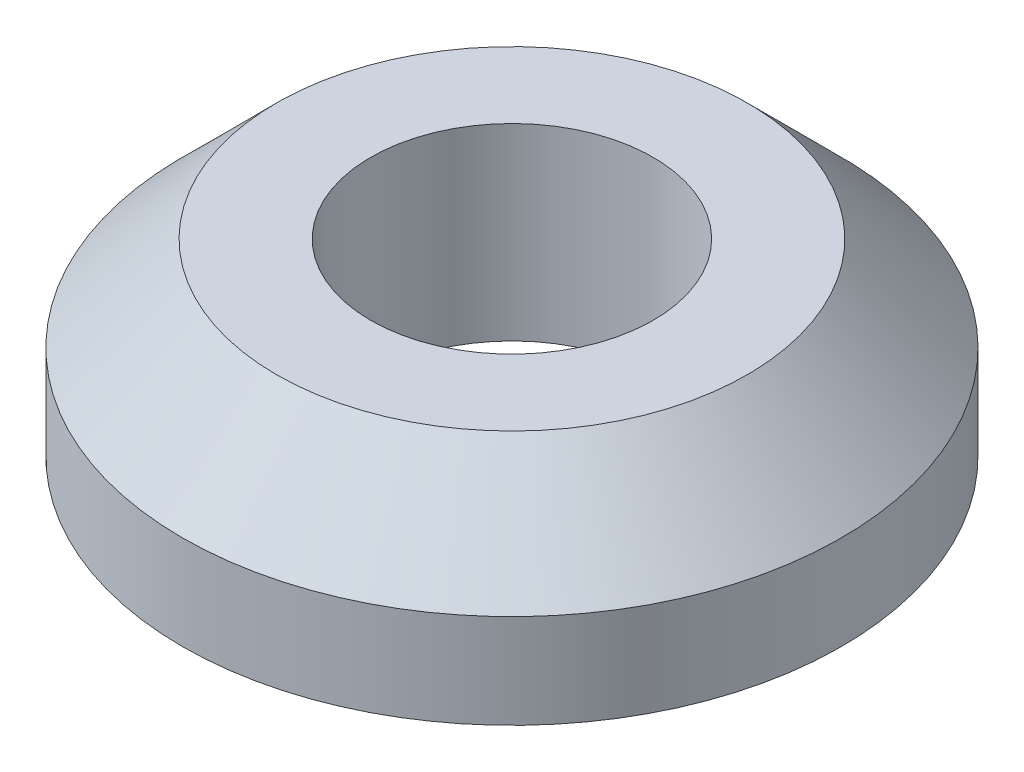
ISO-10303-21;
HEADER;
FILE_DESCRIPTION(('STEP AP214'),'2;1');
FILE_NAME('part.step','',(''),(''),'','','');
FILE_SCHEMA(('AUTOMOTIVE_DESIGN { 1 0 10303 214 1 1 1 1 }'));
ENDSEC;
DATA;
#1=APPLICATION_CONTEXT('core data for automotive mechanical design processes');
#2=APPLICATION_PROTOCOL_DEFINITION('international standard','automotive_design',2000,#1);
#3=PRODUCT_CONTEXT('',#1,'mechanical');
#4=PRODUCT('Part','Part','',(#3));
#5=PRODUCT_RELATED_PRODUCT_CATEGORY('part','',(#4));
#6=PRODUCT_DEFINITION_FORMATION('','',#4);
#7=PRODUCT_DEFINITION_CONTEXT('part definition',#1,'design');
#8=PRODUCT_DEFINITION('design','',#6,#7);
#9=PRODUCT_DEFINITION_SHAPE('','',#8);
#10=(LENGTH_UNIT() NAMED_UNIT(*) SI_UNIT(.MILLI.,.METRE.));
#11=(NAMED_UNIT(*) PLANE_ANGLE_UNIT() SI_UNIT($,.RADIAN.));
#12=(NAMED_UNIT(*) SI_UNIT($,.STERADIAN.) SOLID_ANGLE_UNIT());
#13=UNCERTAINTY_MEASURE_WITH_UNIT(LENGTH_MEASURE(1.E-05),#10,'distance_accuracy_value','');
#14=(GEOMETRIC_REPRESENTATION_CONTEXT(3) GLOBAL_UNCERTAINTY_ASSIGNED_CONTEXT((#13)) GLOBAL_UNIT_ASSIGNED_CONTEXT((#10,
#11,#12)) REPRESENTATION_CONTEXT('',''));
#15=CARTESIAN_POINT('',(0.,0.,0.));
#16=DIRECTION('',(0.,0.,1.));
#17=DIRECTION('',(1.,0.,0.));
#18=AXIS2_PLACEMENT_3D('',#15,#16,#17);
#19=CARTESIAN_POINT('',(0.,2.,0.));
#20=DIRECTION('',(0.,-1.,0.));
#21=DIRECTION('',(0.,0.,-1.));
#22=AXIS2_PLACEMENT_3D('',#19,#20,#21);
#23=CYLINDRICAL_SURFACE('',#22,3.5);
#24=CARTESIAN_POINT('',(0.,0.999999999999994,0.));
#25=DIRECTION('',(0.,1.,0.));
#26=DIRECTION('',(0.,0.,1.));
#27=AXIS2_PLACEMENT_3D('',#24,#25,#26);
#28=CIRCLE('',#27,3.5);
#29=CARTESIAN_POINT('',(0.,0.999999999999994,3.5));
#30=VERTEX_POINT('',#29);
#31=EDGE_CURVE('E10',#30,#30,#28,.F.);
#32=ORIENTED_EDGE('',*,*,#31,.T.);
#33=EDGE_LOOP('',(#32));
#34=FACE_BOUND('',#33,.T.);
#35=CARTESIAN_POINT('',(0.,0.,0.));
#36=DIRECTION('',(0.,1.,0.));
#37=DIRECTION('',(0.,0.,1.));
#38=AXIS2_PLACEMENT_3D('',#35,#36,#37);
#39=CIRCLE('',#38,3.5);
#40=CARTESIAN_POINT('',(0.,0.,3.5));
#41=VERTEX_POINT('',#40);
#42=EDGE_CURVE('E53',#41,#41,#39,.T.);
#43=ORIENTED_EDGE('',*,*,#42,.T.);
#44=EDGE_LOOP('',(#43));
#45=FACE_BOUND('',#44,.T.);
#46=ADVANCED_FACE('F39',(#34,#45),#23,.T.);
#47=CARTESIAN_POINT('',(0.,2.,0.));
#48=DIRECTION('',(0.,1.,0.));
#49=DIRECTION('',(0.,0.,1.));
#50=AXIS2_PLACEMENT_3D('',#47,#48,#49);
#51=PLANE('',#50);
#52=CARTESIAN_POINT('',(0.,2.,0.));
#53=DIRECTION('',(0.,1.,0.));
#54=DIRECTION('',(0.,0.,1.));
#55=AXIS2_PLACEMENT_3D('',#52,#53,#54);
#56=CIRCLE('',#55,2.5);
#57=CARTESIAN_POINT('',(0.,2.,2.5));
#58=VERTEX_POINT('',#57);
#59=EDGE_CURVE('E48',#58,#58,#56,.T.);
#60=ORIENTED_EDGE('',*,*,#59,.T.);
#61=EDGE_LOOP('',(#60));
#62=FACE_BOUND('',#61,.T.);
#63=CARTESIAN_POINT('',(0.,2.,0.));
#64=DIRECTION('',(0.,1.,0.));
#65=DIRECTION('',(0.,0.,1.));
#66=AXIS2_PLACEMENT_3D('',#63,#64,#65);
#67=CIRCLE('',#66,1.5);
#68=CARTESIAN_POINT('',(0.,2.,1.5));
#69=VERTEX_POINT('',#68);
#70=EDGE_CURVE('E61',#69,#69,#67,.T.);
#71=ORIENTED_EDGE('',*,*,#70,.F.);
#72=EDGE_LOOP('',(#71));
#73=FACE_BOUND('',#72,.T.);
#74=ADVANCED_FACE('F78',(#62,#73),#51,.T.);
#75=CARTESIAN_POINT('',(0.,0.,0.));
#76=DIRECTION('',(0.,1.,0.));
#77=DIRECTION('',(0.,0.,1.));
#78=AXIS2_PLACEMENT_3D('',#75,#76,#77);
#79=PLANE('',#78);
#80=CARTESIAN_POINT('',(0.,0.,0.));
#81=DIRECTION('',(0.,1.,0.));
#82=DIRECTION('',(0.,0.,1.));
#83=AXIS2_PLACEMENT_3D('',#80,#81,#82);
#84=CIRCLE('',#83,1.5);
#85=CARTESIAN_POINT('',(0.,0.,1.5));
#86=VERTEX_POINT('',#85);
#87=EDGE_CURVE('E58',#86,#86,#84,.T.);
#88=ORIENTED_EDGE('',*,*,#87,.T.);
#89=EDGE_LOOP('',(#88));
#90=FACE_BOUND('',#89,.T.);
#91=ORIENTED_EDGE('',*,*,#42,.F.);
#92=EDGE_LOOP('',(#91));
#93=FACE_BOUND('',#92,.T.);
#94=ADVANCED_FACE('F69',(#90,#93),#79,.F.);
#95=CARTESIAN_POINT('',(0.,0.,0.));
#96=DIRECTION('',(0.,1.,0.));
#97=DIRECTION('',(0.,0.,1.));
#98=AXIS2_PLACEMENT_3D('',#95,#96,#97);
#99=CYLINDRICAL_SURFACE('',#98,1.5);
#100=ORIENTED_EDGE('',*,*,#87,.F.);
#101=EDGE_LOOP('',(#100));
#102=FACE_BOUND('',#101,.T.);
#103=ORIENTED_EDGE('',*,*,#70,.T.);
#104=EDGE_LOOP('',(#103));
#105=FACE_BOUND('',#104,.T.);
#106=ADVANCED_FACE('F72',(#102,#105),#99,.F.);
#107=CARTESIAN_POINT('',(0.,2.,0.));
#108=DIRECTION('',(0.,-1.,0.));
#109=DIRECTION('',(0.,0.,-1.));
#110=AXIS2_PLACEMENT_3D('',#107,#108,#109);
#111=CONICAL_SURFACE('',#110,2.5,0.785398163397447);
#112=ORIENTED_EDGE('',*,*,#31,.F.);
#113=EDGE_LOOP('',(#112));
#114=FACE_BOUND('',#113,.T.);
#115=ORIENTED_EDGE('',*,*,#59,.F.);
#116=EDGE_LOOP('',(#115));
#117=FACE_BOUND('',#116,.T.);
#118=ADVANCED_FACE('F42',(#114,#117),#111,.T.);
#119=CLOSED_SHELL('',(#46,#74,#94,#106,#118));
#120=MANIFOLD_SOLID_BREP('B2',#119);
#121=ADVANCED_BREP_SHAPE_REPRESENTATION('',(#18,#120),#14);
#122=SHAPE_DEFINITION_REPRESENTATION(#9,#121);
ENDSEC;
END-ISO-10303-21;
